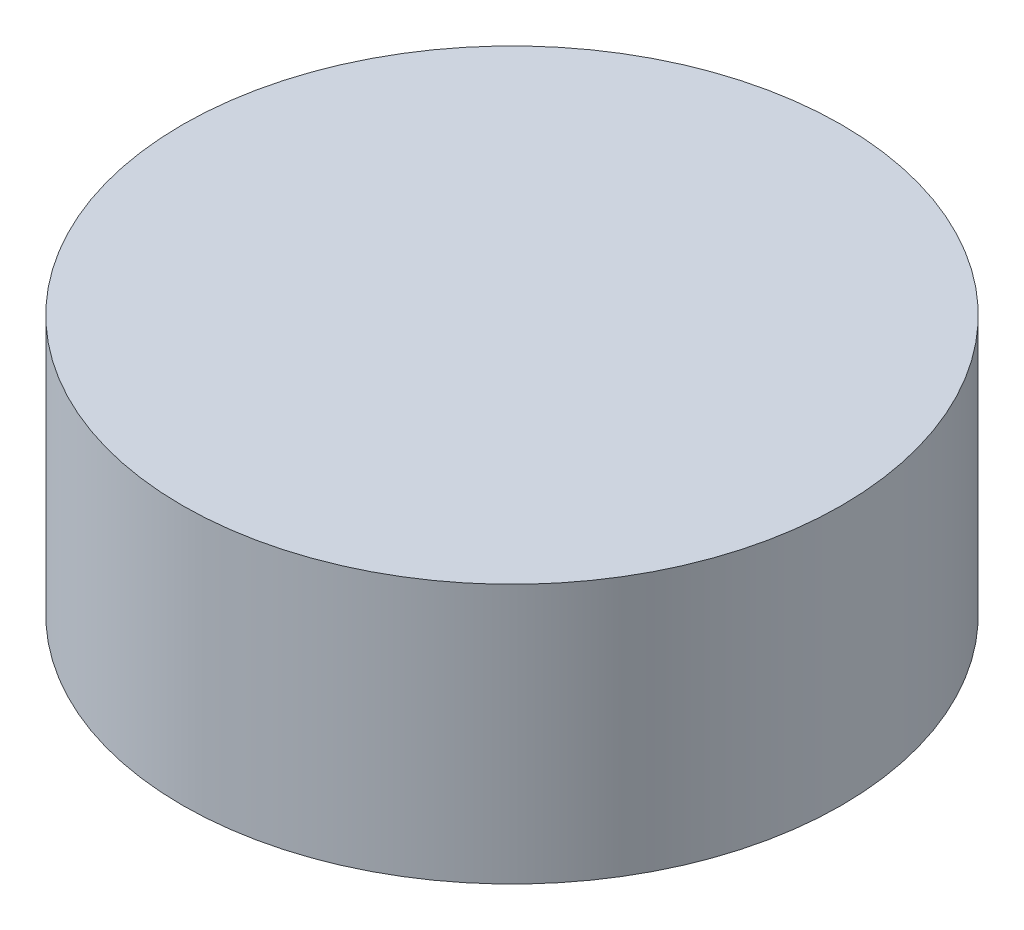
ISO-10303-21;
HEADER;
FILE_DESCRIPTION(('STEP AP214'),'2;1');
FILE_NAME('part.step','',(''),(''),'','','');
FILE_SCHEMA(('AUTOMOTIVE_DESIGN { 1 0 10303 214 1 1 1 1 }'));
ENDSEC;
DATA;
#1=APPLICATION_CONTEXT('core data for automotive mechanical design processes');
#2=APPLICATION_PROTOCOL_DEFINITION('international standard','automotive_design',2000,#1);
#3=PRODUCT_CONTEXT('',#1,'mechanical');
#4=PRODUCT('Part','Part','',(#3));
#5=PRODUCT_RELATED_PRODUCT_CATEGORY('part','',(#4));
#6=PRODUCT_DEFINITION_FORMATION('','',#4);
#7=PRODUCT_DEFINITION_CONTEXT('part definition',#1,'design');
#8=PRODUCT_DEFINITION('design','',#6,#7);
#9=PRODUCT_DEFINITION_SHAPE('','',#8);
#10=(LENGTH_UNIT() NAMED_UNIT(*) SI_UNIT(.MILLI.,.METRE.));
#11=(NAMED_UNIT(*) PLANE_ANGLE_UNIT() SI_UNIT($,.RADIAN.));
#12=(NAMED_UNIT(*) SI_UNIT($,.STERADIAN.) SOLID_ANGLE_UNIT());
#13=UNCERTAINTY_MEASURE_WITH_UNIT(LENGTH_MEASURE(1.E-05),#10,'distance_accuracy_value','');
#14=(GEOMETRIC_REPRESENTATION_CONTEXT(3) GLOBAL_UNCERTAINTY_ASSIGNED_CONTEXT((#13)) GLOBAL_UNIT_ASSIGNED_CONTEXT((#10,
#11,#12)) REPRESENTATION_CONTEXT('',''));
#15=CARTESIAN_POINT('',(0.,0.,0.));
#16=DIRECTION('',(0.,0.,1.));
#17=DIRECTION('',(1.,0.,0.));
#18=AXIS2_PLACEMENT_3D('',#15,#16,#17);
#19=CARTESIAN_POINT('',(0.,20.,0.));
#20=DIRECTION('',(0.,-1.,0.));
#21=DIRECTION('',(0.,0.,-1.));
#22=AXIS2_PLACEMENT_3D('',#19,#20,#21);
#23=CYLINDRICAL_SURFACE('',#22,25.4);
#24=CARTESIAN_POINT('',(0.,20.,0.));
#25=DIRECTION('',(0.,1.,0.));
#26=DIRECTION('',(0.,0.,1.));
#27=AXIS2_PLACEMENT_3D('',#24,#25,#26);
#28=CIRCLE('',#27,25.4);
#29=CARTESIAN_POINT('',(0.,20.,25.4));
#30=VERTEX_POINT('',#29);
#31=EDGE_CURVE('E10',#30,#30,#28,.T.);
#32=ORIENTED_EDGE('',*,*,#31,.F.);
#33=EDGE_LOOP('',(#32));
#34=FACE_BOUND('',#33,.T.);
#35=CARTESIAN_POINT('',(0.,0.,0.));
#36=DIRECTION('',(0.,1.,0.));
#37=DIRECTION('',(0.,0.,1.));
#38=AXIS2_PLACEMENT_3D('',#35,#36,#37);
#39=CIRCLE('',#38,25.4);
#40=CARTESIAN_POINT('',(0.,0.,25.4));
#41=VERTEX_POINT('',#40);
#42=EDGE_CURVE('E34',#41,#41,#39,.T.);
#43=ORIENTED_EDGE('',*,*,#42,.T.);
#44=EDGE_LOOP('',(#43));
#45=FACE_BOUND('',#44,.T.);
#46=ADVANCED_FACE('F31',(#34,#45),#23,.T.);
#47=CARTESIAN_POINT('',(0.,20.,0.));
#48=DIRECTION('',(0.,1.,0.));
#49=DIRECTION('',(0.,0.,1.));
#50=AXIS2_PLACEMENT_3D('',#47,#48,#49);
#51=PLANE('',#50);
#52=ORIENTED_EDGE('',*,*,#31,.T.);
#53=EDGE_LOOP('',(#52));
#54=FACE_BOUND('',#53,.T.);
#55=ADVANCED_FACE('F46',(#54),#51,.T.);
#56=CARTESIAN_POINT('',(0.,0.,0.));
#57=DIRECTION('',(0.,1.,0.));
#58=DIRECTION('',(0.,0.,1.));
#59=AXIS2_PLACEMENT_3D('',#56,#57,#58);
#60=PLANE('',#59);
#61=ORIENTED_EDGE('',*,*,#42,.F.);
#62=EDGE_LOOP('',(#61));
#63=FACE_BOUND('',#62,.T.);
#64=ADVANCED_FACE('F44',(#63),#60,.F.);
#65=CLOSED_SHELL('',(#46,#55,#64));
#66=MANIFOLD_SOLID_BREP('B2',#65);
#67=ADVANCED_BREP_SHAPE_REPRESENTATION('',(#18,#66),#14);
#68=SHAPE_DEFINITION_REPRESENTATION(#9,#67);
ENDSEC;
END-ISO-10303-21;
